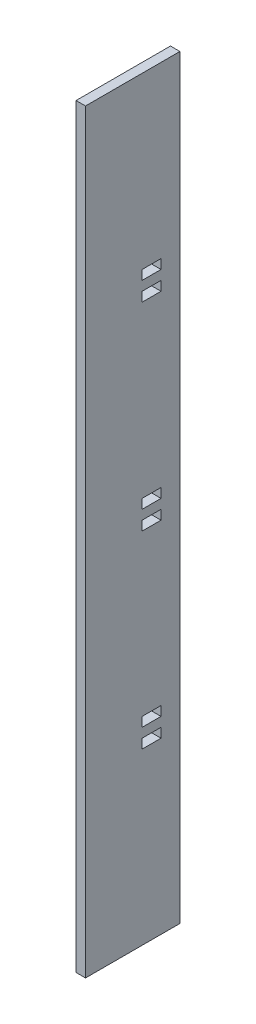
ISO-10303-21;
HEADER;
FILE_DESCRIPTION(('STEP AP214'),'2;1');
FILE_NAME('part.step','',(''),(''),'','','');
FILE_SCHEMA(('AUTOMOTIVE_DESIGN { 1 0 10303 214 1 1 1 1 }'));
ENDSEC;
DATA;
#1=APPLICATION_CONTEXT('core data for automotive mechanical design processes');
#2=APPLICATION_PROTOCOL_DEFINITION('international standard','automotive_design',2000,#1);
#3=PRODUCT_CONTEXT('',#1,'mechanical');
#4=PRODUCT('Part','Part','',(#3));
#5=PRODUCT_RELATED_PRODUCT_CATEGORY('part','',(#4));
#6=PRODUCT_DEFINITION_FORMATION('','',#4);
#7=PRODUCT_DEFINITION_CONTEXT('part definition',#1,'design');
#8=PRODUCT_DEFINITION('design','',#6,#7);
#9=PRODUCT_DEFINITION_SHAPE('','',#8);
#10=(LENGTH_UNIT() NAMED_UNIT(*) SI_UNIT(.MILLI.,.METRE.));
#11=(NAMED_UNIT(*) PLANE_ANGLE_UNIT() SI_UNIT($,.RADIAN.));
#12=(NAMED_UNIT(*) SI_UNIT($,.STERADIAN.) SOLID_ANGLE_UNIT());
#13=UNCERTAINTY_MEASURE_WITH_UNIT(LENGTH_MEASURE(1.E-05),#10,'distance_accuracy_value','');
#14=(GEOMETRIC_REPRESENTATION_CONTEXT(3) GLOBAL_UNCERTAINTY_ASSIGNED_CONTEXT((#13)) GLOBAL_UNIT_ASSIGNED_CONTEXT((#10,
#11,#12)) REPRESENTATION_CONTEXT('',''));
#15=CARTESIAN_POINT('',(0.,0.,0.));
#16=DIRECTION('',(0.,0.,1.));
#17=DIRECTION('',(1.,0.,0.));
#18=AXIS2_PLACEMENT_3D('',#15,#16,#17);
#19=CARTESIAN_POINT('',(6.35,0.,12.7));
#20=DIRECTION('',(0.,0.,1.));
#21=DIRECTION('',(-1.,0.,0.));
#22=AXIS2_PLACEMENT_3D('',#19,#20,#21);
#23=PLANE('',#22);
#24=DIRECTION('',(0.,-1.,0.));
#25=VECTOR('',#24,1.);
#26=CARTESIAN_POINT('',(0.,0.,12.7));
#27=LINE('',#26,#25);
#28=CARTESIAN_POINT('',(0.,381.,12.7));
#29=VERTEX_POINT('',#28);
#30=CARTESIAN_POINT('',(0.,374.65,12.7));
#31=VERTEX_POINT('',#30);
#32=EDGE_CURVE('E314',#29,#31,#27,.T.);
#33=ORIENTED_EDGE('',*,*,#32,.T.);
#34=DIRECTION('',(-1.,0.,0.));
#35=VECTOR('',#34,1.);
#36=CARTESIAN_POINT('',(6.35,374.65,12.7));
#37=LINE('',#36,#35);
#38=CARTESIAN_POINT('',(6.35,374.65,12.7));
#39=VERTEX_POINT('',#38);
#40=EDGE_CURVE('E322',#39,#31,#37,.T.);
#41=ORIENTED_EDGE('',*,*,#40,.F.);
#42=DIRECTION('',(0.,-1.,0.));
#43=VECTOR('',#42,1.);
#44=CARTESIAN_POINT('',(6.35,0.,12.7));
#45=LINE('',#44,#43);
#46=CARTESIAN_POINT('',(6.35,381.,12.7));
#47=VERTEX_POINT('',#46);
#48=EDGE_CURVE('E245',#47,#39,#45,.T.);
#49=ORIENTED_EDGE('',*,*,#48,.F.);
#50=DIRECTION('',(-1.,0.,0.));
#51=VECTOR('',#50,1.);
#52=CARTESIAN_POINT('',(6.35,381.,12.7));
#53=LINE('',#52,#51);
#54=EDGE_CURVE('E11',#47,#29,#53,.T.);
#55=ORIENTED_EDGE('',*,*,#54,.T.);
#56=EDGE_LOOP('',(#33,#41,#49,#55));
#57=FACE_BOUND('',#56,.T.);
#58=ADVANCED_FACE('F35',(#57),#23,.T.);
#59=CARTESIAN_POINT('',(6.35,381.,0.));
#60=DIRECTION('',(0.,1.,0.));
#61=DIRECTION('',(0.,0.,-1.));
#62=AXIS2_PLACEMENT_3D('',#59,#60,#61);
#63=PLANE('',#62);
#64=DIRECTION('',(0.,0.,1.));
#65=VECTOR('',#64,1.);
#66=CARTESIAN_POINT('',(0.,381.,0.));
#67=LINE('',#66,#65);
#68=CARTESIAN_POINT('',(0.,381.,25.4));
#69=VERTEX_POINT('',#68);
#70=EDGE_CURVE('E317',#29,#69,#67,.T.);
#71=ORIENTED_EDGE('',*,*,#70,.F.);
#72=ORIENTED_EDGE('',*,*,#54,.F.);
#73=DIRECTION('',(0.,0.,1.));
#74=VECTOR('',#73,1.);
#75=CARTESIAN_POINT('',(6.35,381.,0.));
#76=LINE('',#75,#74);
#77=CARTESIAN_POINT('',(6.35,381.,25.4));
#78=VERTEX_POINT('',#77);
#79=EDGE_CURVE('E232',#47,#78,#76,.T.);
#80=ORIENTED_EDGE('',*,*,#79,.T.);
#81=DIRECTION('',(-1.,0.,0.));
#82=VECTOR('',#81,1.);
#83=CARTESIAN_POINT('',(6.35,381.,25.4));
#84=LINE('',#83,#82);
#85=EDGE_CURVE('E45',#78,#69,#84,.T.);
#86=ORIENTED_EDGE('',*,*,#85,.T.);
#87=EDGE_LOOP('',(#71,#72,#80,#86));
#88=FACE_BOUND('',#87,.T.);
#89=ADVANCED_FACE('F243',(#88),#63,.F.);
#90=CARTESIAN_POINT('',(6.35,0.,25.4));
#91=DIRECTION('',(0.,0.,1.));
#92=DIRECTION('',(-1.,0.,0.));
#93=AXIS2_PLACEMENT_3D('',#90,#91,#92);
#94=PLANE('',#93);
#95=DIRECTION('',(0.,-1.,0.));
#96=VECTOR('',#95,1.);
#97=CARTESIAN_POINT('',(0.,0.,25.4));
#98=LINE('',#97,#96);
#99=CARTESIAN_POINT('',(0.,374.65,25.4));
#100=VERTEX_POINT('',#99);
#101=EDGE_CURVE('E238',#69,#100,#98,.T.);
#102=ORIENTED_EDGE('',*,*,#101,.F.);
#103=ORIENTED_EDGE('',*,*,#85,.F.);
#104=DIRECTION('',(0.,-1.,0.));
#105=VECTOR('',#104,1.);
#106=CARTESIAN_POINT('',(6.35,0.,25.4));
#107=LINE('',#106,#105);
#108=CARTESIAN_POINT('',(6.35,374.65,25.4));
#109=VERTEX_POINT('',#108);
#110=EDGE_CURVE('E228',#78,#109,#107,.T.);
#111=ORIENTED_EDGE('',*,*,#110,.T.);
#112=DIRECTION('',(-1.,0.,0.));
#113=VECTOR('',#112,1.);
#114=CARTESIAN_POINT('',(6.35,374.65,25.4));
#115=LINE('',#114,#113);
#116=EDGE_CURVE('E241',#109,#100,#115,.T.);
#117=ORIENTED_EDGE('',*,*,#116,.T.);
#118=EDGE_LOOP('',(#102,#103,#111,#117));
#119=FACE_BOUND('',#118,.T.);
#120=ADVANCED_FACE('F237',(#119),#94,.F.);
#121=CARTESIAN_POINT('',(6.35,247.65,0.));
#122=DIRECTION('',(0.,1.,0.));
#123=DIRECTION('',(0.,0.,-1.));
#124=AXIS2_PLACEMENT_3D('',#121,#122,#123);
#125=PLANE('',#124);
#126=DIRECTION('',(0.,0.,1.));
#127=VECTOR('',#126,1.);
#128=CARTESIAN_POINT('',(0.,247.65,0.));
#129=LINE('',#128,#127);
#130=CARTESIAN_POINT('',(0.,247.65,12.7));
#131=VERTEX_POINT('',#130);
#132=CARTESIAN_POINT('',(0.,247.65,25.4));
#133=VERTEX_POINT('',#132);
#134=EDGE_CURVE('E304',#131,#133,#129,.T.);
#135=ORIENTED_EDGE('',*,*,#134,.F.);
#136=DIRECTION('',(-1.,0.,0.));
#137=VECTOR('',#136,1.);
#138=CARTESIAN_POINT('',(6.35,247.65,12.7));
#139=LINE('',#138,#137);
#140=CARTESIAN_POINT('',(6.35,247.65,12.7));
#141=VERTEX_POINT('',#140);
#142=EDGE_CURVE('E326',#141,#131,#139,.T.);
#143=ORIENTED_EDGE('',*,*,#142,.F.);
#144=DIRECTION('',(0.,0.,1.));
#145=VECTOR('',#144,1.);
#146=CARTESIAN_POINT('',(6.35,247.65,0.));
#147=LINE('',#146,#145);
#148=CARTESIAN_POINT('',(6.35,247.65,25.4));
#149=VERTEX_POINT('',#148);
#150=EDGE_CURVE('E453',#141,#149,#147,.T.);
#151=ORIENTED_EDGE('',*,*,#150,.T.);
#152=DIRECTION('',(-1.,0.,0.));
#153=VECTOR('',#152,1.);
#154=CARTESIAN_POINT('',(6.35,247.65,25.4));
#155=LINE('',#154,#153);
#156=EDGE_CURVE('E324',#149,#133,#155,.T.);
#157=ORIENTED_EDGE('',*,*,#156,.T.);
#158=EDGE_LOOP('',(#135,#143,#151,#157));
#159=FACE_BOUND('',#158,.T.);
#160=ADVANCED_FACE('F476',(#159),#125,.F.);
#161=CARTESIAN_POINT('',(6.35,0.,25.4000000000001));
#162=DIRECTION('',(0.,0.,1.));
#163=DIRECTION('',(0.,1.,0.));
#164=AXIS2_PLACEMENT_3D('',#161,#162,#163);
#165=PLANE('',#164);
#166=DIRECTION('',(0.,-1.,0.));
#167=VECTOR('',#166,1.);
#168=CARTESIAN_POINT('',(0.,0.,25.4000000000001));
#169=LINE('',#168,#167);
#170=CARTESIAN_POINT('',(0.,241.3,25.4));
#171=VERTEX_POINT('',#170);
#172=EDGE_CURVE('E307',#133,#171,#169,.T.);
#173=ORIENTED_EDGE('',*,*,#172,.F.);
#174=ORIENTED_EDGE('',*,*,#156,.F.);
#175=DIRECTION('',(0.,-1.,0.));
#176=VECTOR('',#175,1.);
#177=CARTESIAN_POINT('',(6.35,0.,25.4000000000001));
#178=LINE('',#177,#176);
#179=CARTESIAN_POINT('',(6.35,241.3,25.4));
#180=VERTEX_POINT('',#179);
#181=EDGE_CURVE('E456',#149,#180,#178,.T.);
#182=ORIENTED_EDGE('',*,*,#181,.T.);
#183=DIRECTION('',(-1.,0.,0.));
#184=VECTOR('',#183,1.);
#185=CARTESIAN_POINT('',(6.35,241.3,25.4));
#186=LINE('',#185,#184);
#187=EDGE_CURVE('E333',#180,#171,#186,.T.);
#188=ORIENTED_EDGE('',*,*,#187,.T.);
#189=EDGE_LOOP('',(#173,#174,#182,#188));
#190=FACE_BOUND('',#189,.T.);
#191=ADVANCED_FACE('F473',(#190),#165,.F.);
#192=CARTESIAN_POINT('',(6.35,241.3,0.));
#193=DIRECTION('',(0.,1.,0.));
#194=DIRECTION('',(0.,0.,-1.));
#195=AXIS2_PLACEMENT_3D('',#192,#193,#194);
#196=PLANE('',#195);
#197=DIRECTION('',(0.,0.,1.));
#198=VECTOR('',#197,1.);
#199=CARTESIAN_POINT('',(0.,241.3,0.));
#200=LINE('',#199,#198);
#201=CARTESIAN_POINT('',(0.,241.3,12.7));
#202=VERTEX_POINT('',#201);
#203=EDGE_CURVE('E310',#202,#171,#200,.T.);
#204=ORIENTED_EDGE('',*,*,#203,.T.);
#205=ORIENTED_EDGE('',*,*,#187,.F.);
#206=DIRECTION('',(0.,0.,1.));
#207=VECTOR('',#206,1.);
#208=CARTESIAN_POINT('',(6.35,241.3,0.));
#209=LINE('',#208,#207);
#210=CARTESIAN_POINT('',(6.35,241.3,12.7));
#211=VERTEX_POINT('',#210);
#212=EDGE_CURVE('E459',#211,#180,#209,.T.);
#213=ORIENTED_EDGE('',*,*,#212,.F.);
#214=DIRECTION('',(-1.,0.,0.));
#215=VECTOR('',#214,1.);
#216=CARTESIAN_POINT('',(6.35,241.3,12.7));
#217=LINE('',#216,#215);
#218=EDGE_CURVE('E329',#211,#202,#217,.T.);
#219=ORIENTED_EDGE('',*,*,#218,.T.);
#220=EDGE_LOOP('',(#204,#205,#213,#219));
#221=FACE_BOUND('',#220,.T.);
#222=ADVANCED_FACE('F470',(#221),#196,.T.);
#223=CARTESIAN_POINT('',(6.35,120.65,0.));
#224=DIRECTION('',(0.,1.,0.));
#225=DIRECTION('',(0.,0.,-1.));
#226=AXIS2_PLACEMENT_3D('',#223,#224,#225);
#227=PLANE('',#226);
#228=DIRECTION('',(0.,0.,1.));
#229=VECTOR('',#228,1.);
#230=CARTESIAN_POINT('',(0.,120.65,0.));
#231=LINE('',#230,#229);
#232=CARTESIAN_POINT('',(0.,120.65,12.7));
#233=VERTEX_POINT('',#232);
#234=CARTESIAN_POINT('',(0.,120.65,25.4));
#235=VERTEX_POINT('',#234);
#236=EDGE_CURVE('E294',#233,#235,#231,.T.);
#237=ORIENTED_EDGE('',*,*,#236,.F.);
#238=DIRECTION('',(-1.,0.,0.));
#239=VECTOR('',#238,1.);
#240=CARTESIAN_POINT('',(6.35,120.65,12.7));
#241=LINE('',#240,#239);
#242=CARTESIAN_POINT('',(6.35,120.65,12.7));
#243=VERTEX_POINT('',#242);
#244=EDGE_CURVE('E338',#243,#233,#241,.T.);
#245=ORIENTED_EDGE('',*,*,#244,.F.);
#246=DIRECTION('',(0.,0.,1.));
#247=VECTOR('',#246,1.);
#248=CARTESIAN_POINT('',(6.35,120.65,0.));
#249=LINE('',#248,#247);
#250=CARTESIAN_POINT('',(6.35,120.65,25.4));
#251=VERTEX_POINT('',#250);
#252=EDGE_CURVE('E443',#243,#251,#249,.T.);
#253=ORIENTED_EDGE('',*,*,#252,.T.);
#254=DIRECTION('',(-1.,0.,0.));
#255=VECTOR('',#254,1.);
#256=CARTESIAN_POINT('',(6.35,120.65,25.4));
#257=LINE('',#256,#255);
#258=EDGE_CURVE('E330',#251,#235,#257,.T.);
#259=ORIENTED_EDGE('',*,*,#258,.T.);
#260=EDGE_LOOP('',(#237,#245,#253,#259));
#261=FACE_BOUND('',#260,.T.);
#262=ADVANCED_FACE('F506',(#261),#227,.F.);
#263=CARTESIAN_POINT('',(6.35,0.,25.4));
#264=DIRECTION('',(0.,0.,1.));
#265=DIRECTION('',(-1.,0.,0.));
#266=AXIS2_PLACEMENT_3D('',#263,#264,#265);
#267=PLANE('',#266);
#268=DIRECTION('',(0.,-1.,0.));
#269=VECTOR('',#268,1.);
#270=CARTESIAN_POINT('',(0.,0.,25.4));
#271=LINE('',#270,#269);
#272=CARTESIAN_POINT('',(0.,114.3,25.4));
#273=VERTEX_POINT('',#272);
#274=EDGE_CURVE('E297',#235,#273,#271,.T.);
#275=ORIENTED_EDGE('',*,*,#274,.F.);
#276=ORIENTED_EDGE('',*,*,#258,.F.);
#277=DIRECTION('',(0.,-1.,0.));
#278=VECTOR('',#277,1.);
#279=CARTESIAN_POINT('',(6.35,0.,25.4));
#280=LINE('',#279,#278);
#281=CARTESIAN_POINT('',(6.35,114.3,25.4));
#282=VERTEX_POINT('',#281);
#283=EDGE_CURVE('E446',#251,#282,#280,.T.);
#284=ORIENTED_EDGE('',*,*,#283,.T.);
#285=DIRECTION('',(-1.,0.,0.));
#286=VECTOR('',#285,1.);
#287=CARTESIAN_POINT('',(6.35,114.3,25.4));
#288=LINE('',#287,#286);
#289=EDGE_CURVE('E345',#282,#273,#288,.T.);
#290=ORIENTED_EDGE('',*,*,#289,.T.);
#291=EDGE_LOOP('',(#275,#276,#284,#290));
#292=FACE_BOUND('',#291,.T.);
#293=ADVANCED_FACE('F519',(#292),#267,.F.);
#294=CARTESIAN_POINT('',(6.35,114.3,0.));
#295=DIRECTION('',(0.,1.,0.));
#296=DIRECTION('',(0.,0.,-1.));
#297=AXIS2_PLACEMENT_3D('',#294,#295,#296);
#298=PLANE('',#297);
#299=DIRECTION('',(0.,0.,1.));
#300=VECTOR('',#299,1.);
#301=CARTESIAN_POINT('',(0.,114.3,0.));
#302=LINE('',#301,#300);
#303=CARTESIAN_POINT('',(0.,114.3,12.7));
#304=VERTEX_POINT('',#303);
#305=EDGE_CURVE('E300',#304,#273,#302,.T.);
#306=ORIENTED_EDGE('',*,*,#305,.T.);
#307=ORIENTED_EDGE('',*,*,#289,.F.);
#308=DIRECTION('',(0.,0.,1.));
#309=VECTOR('',#308,1.);
#310=CARTESIAN_POINT('',(6.35,114.3,0.));
#311=LINE('',#310,#309);
#312=CARTESIAN_POINT('',(6.35,114.3,12.7));
#313=VERTEX_POINT('',#312);
#314=EDGE_CURVE('E449',#313,#282,#311,.T.);
#315=ORIENTED_EDGE('',*,*,#314,.F.);
#316=DIRECTION('',(-1.,0.,0.));
#317=VECTOR('',#316,1.);
#318=CARTESIAN_POINT('',(6.35,114.3,12.7));
#319=LINE('',#318,#317);
#320=EDGE_CURVE('E341',#313,#304,#319,.T.);
#321=ORIENTED_EDGE('',*,*,#320,.T.);
#322=EDGE_LOOP('',(#306,#307,#315,#321));
#323=FACE_BOUND('',#322,.T.);
#324=ADVANCED_FACE('F515',(#323),#298,.T.);
#325=CARTESIAN_POINT('',(6.35,260.35,0.));
#326=DIRECTION('',(0.,1.,0.));
#327=DIRECTION('',(0.,0.,-1.));
#328=AXIS2_PLACEMENT_3D('',#325,#326,#327);
#329=PLANE('',#328);
#330=DIRECTION('',(0.,0.,1.));
#331=VECTOR('',#330,1.);
#332=CARTESIAN_POINT('',(0.,260.35,0.));
#333=LINE('',#332,#331);
#334=CARTESIAN_POINT('',(0.,260.35,12.7));
#335=VERTEX_POINT('',#334);
#336=CARTESIAN_POINT('',(0.,260.35,25.4));
#337=VERTEX_POINT('',#336);
#338=EDGE_CURVE('E284',#335,#337,#333,.T.);
#339=ORIENTED_EDGE('',*,*,#338,.F.);
#340=DIRECTION('',(-1.,0.,0.));
#341=VECTOR('',#340,1.);
#342=CARTESIAN_POINT('',(6.35,260.35,12.7));
#343=LINE('',#342,#341);
#344=CARTESIAN_POINT('',(6.35,260.35,12.7));
#345=VERTEX_POINT('',#344);
#346=EDGE_CURVE('E350',#345,#335,#343,.T.);
#347=ORIENTED_EDGE('',*,*,#346,.F.);
#348=DIRECTION('',(0.,0.,1.));
#349=VECTOR('',#348,1.);
#350=CARTESIAN_POINT('',(6.35,260.35,0.));
#351=LINE('',#350,#349);
#352=CARTESIAN_POINT('',(6.35,260.35,25.4));
#353=VERTEX_POINT('',#352);
#354=EDGE_CURVE('E433',#345,#353,#351,.T.);
#355=ORIENTED_EDGE('',*,*,#354,.T.);
#356=DIRECTION('',(-1.,0.,0.));
#357=VECTOR('',#356,1.);
#358=CARTESIAN_POINT('',(6.35,260.35,25.4));
#359=LINE('',#358,#357);
#360=EDGE_CURVE('E342',#353,#337,#359,.T.);
#361=ORIENTED_EDGE('',*,*,#360,.T.);
#362=EDGE_LOOP('',(#339,#347,#355,#361));
#363=FACE_BOUND('',#362,.T.);
#364=ADVANCED_FACE('F518',(#363),#329,.F.);
#365=CARTESIAN_POINT('',(6.35,0.,25.4));
#366=DIRECTION('',(0.,0.,1.));
#367=DIRECTION('',(-1.,0.,0.));
#368=AXIS2_PLACEMENT_3D('',#365,#366,#367);
#369=PLANE('',#368);
#370=DIRECTION('',(0.,-1.,0.));
#371=VECTOR('',#370,1.);
#372=CARTESIAN_POINT('',(0.,0.,25.4));
#373=LINE('',#372,#371);
#374=CARTESIAN_POINT('',(0.,254.,25.4));
#375=VERTEX_POINT('',#374);
#376=EDGE_CURVE('E287',#337,#375,#373,.T.);
#377=ORIENTED_EDGE('',*,*,#376,.F.);
#378=ORIENTED_EDGE('',*,*,#360,.F.);
#379=DIRECTION('',(0.,-1.,0.));
#380=VECTOR('',#379,1.);
#381=CARTESIAN_POINT('',(6.35,0.,25.4));
#382=LINE('',#381,#380);
#383=CARTESIAN_POINT('',(6.35,254.,25.4));
#384=VERTEX_POINT('',#383);
#385=EDGE_CURVE('E436',#353,#384,#382,.T.);
#386=ORIENTED_EDGE('',*,*,#385,.T.);
#387=DIRECTION('',(-1.,0.,0.));
#388=VECTOR('',#387,1.);
#389=CARTESIAN_POINT('',(6.35,254.,25.4));
#390=LINE('',#389,#388);
#391=EDGE_CURVE('E357',#384,#375,#390,.T.);
#392=ORIENTED_EDGE('',*,*,#391,.T.);
#393=EDGE_LOOP('',(#377,#378,#386,#392));
#394=FACE_BOUND('',#393,.T.);
#395=ADVANCED_FACE('F535',(#394),#369,.F.);
#396=CARTESIAN_POINT('',(6.35,254.,0.));
#397=DIRECTION('',(0.,1.,0.));
#398=DIRECTION('',(0.,0.,-1.));
#399=AXIS2_PLACEMENT_3D('',#396,#397,#398);
#400=PLANE('',#399);
#401=DIRECTION('',(0.,0.,1.));
#402=VECTOR('',#401,1.);
#403=CARTESIAN_POINT('',(0.,254.,0.));
#404=LINE('',#403,#402);
#405=CARTESIAN_POINT('',(0.,254.,12.7));
#406=VERTEX_POINT('',#405);
#407=EDGE_CURVE('E290',#406,#375,#404,.T.);
#408=ORIENTED_EDGE('',*,*,#407,.T.);
#409=ORIENTED_EDGE('',*,*,#391,.F.);
#410=DIRECTION('',(0.,0.,1.));
#411=VECTOR('',#410,1.);
#412=CARTESIAN_POINT('',(6.35,254.,0.));
#413=LINE('',#412,#411);
#414=CARTESIAN_POINT('',(6.35,254.,12.7));
#415=VERTEX_POINT('',#414);
#416=EDGE_CURVE('E439',#415,#384,#413,.T.);
#417=ORIENTED_EDGE('',*,*,#416,.F.);
#418=DIRECTION('',(-1.,0.,0.));
#419=VECTOR('',#418,1.);
#420=CARTESIAN_POINT('',(6.35,254.,12.7));
#421=LINE('',#420,#419);
#422=EDGE_CURVE('E353',#415,#406,#421,.T.);
#423=ORIENTED_EDGE('',*,*,#422,.T.);
#424=EDGE_LOOP('',(#408,#409,#417,#423));
#425=FACE_BOUND('',#424,.T.);
#426=ADVANCED_FACE('F531',(#425),#400,.T.);
#427=CARTESIAN_POINT('',(6.35,0.,0.));
#428=DIRECTION('',(0.,1.,0.));
#429=DIRECTION('',(0.,0.,-1.));
#430=AXIS2_PLACEMENT_3D('',#427,#428,#429);
#431=PLANE('',#430);
#432=DIRECTION('',(0.,0.,1.));
#433=VECTOR('',#432,1.);
#434=CARTESIAN_POINT('',(0.,0.,0.));
#435=LINE('',#434,#433);
#436=CARTESIAN_POINT('',(0.,0.,0.));
#437=VERTEX_POINT('',#436);
#438=CARTESIAN_POINT('',(0.,0.,63.5));
#439=VERTEX_POINT('',#438);
#440=EDGE_CURVE('E274',#437,#439,#435,.T.);
#441=ORIENTED_EDGE('',*,*,#440,.F.);
#442=DIRECTION('',(-1.,0.,0.));
#443=VECTOR('',#442,1.);
#444=CARTESIAN_POINT('',(6.35,0.,0.));
#445=LINE('',#444,#443);
#446=CARTESIAN_POINT('',(6.35,0.,0.));
#447=VERTEX_POINT('',#446);
#448=EDGE_CURVE('E362',#447,#437,#445,.T.);
#449=ORIENTED_EDGE('',*,*,#448,.F.);
#450=DIRECTION('',(0.,0.,1.));
#451=VECTOR('',#450,1.);
#452=CARTESIAN_POINT('',(6.35,0.,0.));
#453=LINE('',#452,#451);
#454=CARTESIAN_POINT('',(6.35,0.,63.5));
#455=VERTEX_POINT('',#454);
#456=EDGE_CURVE('E423',#447,#455,#453,.T.);
#457=ORIENTED_EDGE('',*,*,#456,.T.);
#458=DIRECTION('',(-1.,0.,0.));
#459=VECTOR('',#458,1.);
#460=CARTESIAN_POINT('',(6.35,0.,63.5));
#461=LINE('',#460,#459);
#462=EDGE_CURVE('E354',#455,#439,#461,.T.);
#463=ORIENTED_EDGE('',*,*,#462,.T.);
#464=EDGE_LOOP('',(#441,#449,#457,#463));
#465=FACE_BOUND('',#464,.T.);
#466=ADVANCED_FACE('F534',(#465),#431,.F.);
#467=CARTESIAN_POINT('',(6.35,0.,63.5));
#468=DIRECTION('',(0.,0.,-1.));
#469=DIRECTION('',(1.,0.,0.));
#470=AXIS2_PLACEMENT_3D('',#467,#468,#469);
#471=PLANE('',#470);
#472=DIRECTION('',(0.,1.,0.));
#473=VECTOR('',#472,1.);
#474=CARTESIAN_POINT('',(0.,0.,63.5));
#475=LINE('',#474,#473);
#476=CARTESIAN_POINT('',(0.,508.,63.5));
#477=VERTEX_POINT('',#476);
#478=EDGE_CURVE('E277',#439,#477,#475,.T.);
#479=ORIENTED_EDGE('',*,*,#478,.F.);
#480=ORIENTED_EDGE('',*,*,#462,.F.);
#481=DIRECTION('',(0.,1.,0.));
#482=VECTOR('',#481,1.);
#483=CARTESIAN_POINT('',(6.35,0.,63.5));
#484=LINE('',#483,#482);
#485=CARTESIAN_POINT('',(6.35,508.,63.5));
#486=VERTEX_POINT('',#485);
#487=EDGE_CURVE('E426',#455,#486,#484,.T.);
#488=ORIENTED_EDGE('',*,*,#487,.T.);
#489=DIRECTION('',(-1.,0.,0.));
#490=VECTOR('',#489,1.);
#491=CARTESIAN_POINT('',(6.35,508.,63.5));
#492=LINE('',#491,#490);
#493=EDGE_CURVE('E369',#486,#477,#492,.T.);
#494=ORIENTED_EDGE('',*,*,#493,.T.);
#495=EDGE_LOOP('',(#479,#480,#488,#494));
#496=FACE_BOUND('',#495,.T.);
#497=ADVANCED_FACE('F550',(#496),#471,.F.);
#498=CARTESIAN_POINT('',(6.35,508.,0.));
#499=DIRECTION('',(0.,1.,0.));
#500=DIRECTION('',(0.,0.,-1.));
#501=AXIS2_PLACEMENT_3D('',#498,#499,#500);
#502=PLANE('',#501);
#503=DIRECTION('',(0.,0.,1.));
#504=VECTOR('',#503,1.);
#505=CARTESIAN_POINT('',(0.,508.,0.));
#506=LINE('',#505,#504);
#507=CARTESIAN_POINT('',(0.,508.,0.));
#508=VERTEX_POINT('',#507);
#509=EDGE_CURVE('E280',#508,#477,#506,.T.);
#510=ORIENTED_EDGE('',*,*,#509,.T.);
#511=ORIENTED_EDGE('',*,*,#493,.F.);
#512=DIRECTION('',(0.,0.,1.));
#513=VECTOR('',#512,1.);
#514=CARTESIAN_POINT('',(6.35,508.,0.));
#515=LINE('',#514,#513);
#516=CARTESIAN_POINT('',(6.35,508.,0.));
#517=VERTEX_POINT('',#516);
#518=EDGE_CURVE('E429',#517,#486,#515,.T.);
#519=ORIENTED_EDGE('',*,*,#518,.F.);
#520=DIRECTION('',(-1.,0.,0.));
#521=VECTOR('',#520,1.);
#522=CARTESIAN_POINT('',(6.35,508.,0.));
#523=LINE('',#522,#521);
#524=EDGE_CURVE('E365',#517,#508,#523,.T.);
#525=ORIENTED_EDGE('',*,*,#524,.T.);
#526=EDGE_LOOP('',(#510,#511,#519,#525));
#527=FACE_BOUND('',#526,.T.);
#528=ADVANCED_FACE('F546',(#527),#502,.T.);
#529=CARTESIAN_POINT('',(6.35,0.,25.4));
#530=DIRECTION('',(0.,0.,-1.));
#531=DIRECTION('',(1.,0.,0.));
#532=AXIS2_PLACEMENT_3D('',#529,#530,#531);
#533=PLANE('',#532);
#534=DIRECTION('',(0.,1.,0.));
#535=VECTOR('',#534,1.);
#536=CARTESIAN_POINT('',(0.,0.,25.4));
#537=LINE('',#536,#535);
#538=CARTESIAN_POINT('',(0.,127.,25.4));
#539=VERTEX_POINT('',#538);
#540=CARTESIAN_POINT('',(0.,133.35,25.4));
#541=VERTEX_POINT('',#540);
#542=EDGE_CURVE('E264',#539,#541,#537,.T.);
#543=ORIENTED_EDGE('',*,*,#542,.T.);
#544=DIRECTION('',(-1.,0.,0.));
#545=VECTOR('',#544,1.);
#546=CARTESIAN_POINT('',(6.35,133.35,25.4));
#547=LINE('',#546,#545);
#548=CARTESIAN_POINT('',(6.35,133.35,25.4));
#549=VERTEX_POINT('',#548);
#550=EDGE_CURVE('E374',#549,#541,#547,.T.);
#551=ORIENTED_EDGE('',*,*,#550,.F.);
#552=DIRECTION('',(0.,1.,0.));
#553=VECTOR('',#552,1.);
#554=CARTESIAN_POINT('',(6.35,0.,25.4));
#555=LINE('',#554,#553);
#556=CARTESIAN_POINT('',(6.35,127.,25.4));
#557=VERTEX_POINT('',#556);
#558=EDGE_CURVE('E406',#557,#549,#555,.T.);
#559=ORIENTED_EDGE('',*,*,#558,.F.);
#560=DIRECTION('',(-1.,0.,0.));
#561=VECTOR('',#560,1.);
#562=CARTESIAN_POINT('',(6.35,127.,25.4));
#563=LINE('',#562,#561);
#564=EDGE_CURVE('E366',#557,#539,#563,.T.);
#565=ORIENTED_EDGE('',*,*,#564,.T.);
#566=EDGE_LOOP('',(#543,#551,#559,#565));
#567=FACE_BOUND('',#566,.T.);
#568=ADVANCED_FACE('F549',(#567),#533,.T.);
#569=CARTESIAN_POINT('',(6.35,127.,0.));
#570=DIRECTION('',(0.,1.,0.));
#571=DIRECTION('',(0.,0.,-1.));
#572=AXIS2_PLACEMENT_3D('',#569,#570,#571);
#573=PLANE('',#572);
#574=DIRECTION('',(0.,0.,1.));
#575=VECTOR('',#574,1.);
#576=CARTESIAN_POINT('',(0.,127.,0.));
#577=LINE('',#576,#575);
#578=CARTESIAN_POINT('',(0.,127.,12.7));
#579=VERTEX_POINT('',#578);
#580=EDGE_CURVE('E267',#579,#539,#577,.T.);
#581=ORIENTED_EDGE('',*,*,#580,.T.);
#582=ORIENTED_EDGE('',*,*,#564,.F.);
#583=DIRECTION('',(0.,0.,1.));
#584=VECTOR('',#583,1.);
#585=CARTESIAN_POINT('',(6.35,127.,0.));
#586=LINE('',#585,#584);
#587=CARTESIAN_POINT('',(6.35,127.,12.7));
#588=VERTEX_POINT('',#587);
#589=EDGE_CURVE('E416',#588,#557,#586,.T.);
#590=ORIENTED_EDGE('',*,*,#589,.F.);
#591=DIRECTION('',(-1.,0.,0.));
#592=VECTOR('',#591,1.);
#593=CARTESIAN_POINT('',(6.35,127.,12.7));
#594=LINE('',#593,#592);
#595=EDGE_CURVE('E380',#588,#579,#594,.T.);
#596=ORIENTED_EDGE('',*,*,#595,.T.);
#597=EDGE_LOOP('',(#581,#582,#590,#596));
#598=FACE_BOUND('',#597,.T.);
#599=ADVANCED_FACE('F564',(#598),#573,.T.);
#600=CARTESIAN_POINT('',(6.35,0.,12.7));
#601=DIRECTION('',(0.,0.,-1.));
#602=DIRECTION('',(1.,0.,0.));
#603=AXIS2_PLACEMENT_3D('',#600,#601,#602);
#604=PLANE('',#603);
#605=DIRECTION('',(0.,1.,0.));
#606=VECTOR('',#605,1.);
#607=CARTESIAN_POINT('',(0.,0.,12.7));
#608=LINE('',#607,#606);
#609=CARTESIAN_POINT('',(0.,133.35,12.7));
#610=VERTEX_POINT('',#609);
#611=EDGE_CURVE('E269',#579,#610,#608,.T.);
#612=ORIENTED_EDGE('',*,*,#611,.F.);
#613=ORIENTED_EDGE('',*,*,#595,.F.);
#614=DIRECTION('',(0.,1.,0.));
#615=VECTOR('',#614,1.);
#616=CARTESIAN_POINT('',(6.35,0.,12.7));
#617=LINE('',#616,#615);
#618=CARTESIAN_POINT('',(6.35,133.35,12.7));
#619=VERTEX_POINT('',#618);
#620=EDGE_CURVE('E418',#588,#619,#617,.T.);
#621=ORIENTED_EDGE('',*,*,#620,.T.);
#622=DIRECTION('',(-1.,0.,0.));
#623=VECTOR('',#622,1.);
#624=CARTESIAN_POINT('',(6.35,133.35,12.7));
#625=LINE('',#624,#623);
#626=EDGE_CURVE('E377',#619,#610,#625,.T.);
#627=ORIENTED_EDGE('',*,*,#626,.T.);
#628=EDGE_LOOP('',(#612,#613,#621,#627));
#629=FACE_BOUND('',#628,.T.);
#630=ADVANCED_FACE('F561',(#629),#604,.F.);
#631=CARTESIAN_POINT('',(6.35,387.35,0.));
#632=DIRECTION('',(0.,1.,0.));
#633=DIRECTION('',(0.,0.,-1.));
#634=AXIS2_PLACEMENT_3D('',#631,#632,#633);
#635=PLANE('',#634);
#636=DIRECTION('',(0.,0.,1.));
#637=VECTOR('',#636,1.);
#638=CARTESIAN_POINT('',(0.,387.35,0.));
#639=LINE('',#638,#637);
#640=CARTESIAN_POINT('',(0.,387.35,12.7));
#641=VERTEX_POINT('',#640);
#642=CARTESIAN_POINT('',(0.,387.35,25.4));
#643=VERTEX_POINT('',#642);
#644=EDGE_CURVE('E253',#641,#643,#639,.T.);
#645=ORIENTED_EDGE('',*,*,#644,.T.);
#646=DIRECTION('',(-1.,0.,0.));
#647=VECTOR('',#646,1.);
#648=CARTESIAN_POINT('',(6.35,387.35,25.4));
#649=LINE('',#648,#647);
#650=CARTESIAN_POINT('',(6.35,387.35,25.4));
#651=VERTEX_POINT('',#650);
#652=EDGE_CURVE('E252',#651,#643,#649,.T.);
#653=ORIENTED_EDGE('',*,*,#652,.F.);
#654=DIRECTION('',(0.,0.,1.));
#655=VECTOR('',#654,1.);
#656=CARTESIAN_POINT('',(6.35,387.35,0.));
#657=LINE('',#656,#655);
#658=CARTESIAN_POINT('',(6.35,387.35,12.7));
#659=VERTEX_POINT('',#658);
#660=EDGE_CURVE('E321',#659,#651,#657,.T.);
#661=ORIENTED_EDGE('',*,*,#660,.F.);
#662=DIRECTION('',(-1.,0.,0.));
#663=VECTOR('',#662,1.);
#664=CARTESIAN_POINT('',(6.35,387.35,12.7));
#665=LINE('',#664,#663);
#666=EDGE_CURVE('E39',#659,#641,#665,.T.);
#667=ORIENTED_EDGE('',*,*,#666,.T.);
#668=EDGE_LOOP('',(#645,#653,#661,#667));
#669=FACE_BOUND('',#668,.T.);
#670=ADVANCED_FACE('F37',(#669),#635,.T.);
#671=CARTESIAN_POINT('',(6.35,0.,12.7));
#672=DIRECTION('',(0.,0.,-1.));
#673=DIRECTION('',(1.,0.,0.));
#674=AXIS2_PLACEMENT_3D('',#671,#672,#673);
#675=PLANE('',#674);
#676=DIRECTION('',(0.,1.,0.));
#677=VECTOR('',#676,1.);
#678=CARTESIAN_POINT('',(0.,0.,12.7));
#679=LINE('',#678,#677);
#680=CARTESIAN_POINT('',(0.,393.7,12.7));
#681=VERTEX_POINT('',#680);
#682=EDGE_CURVE('E256',#641,#681,#679,.T.);
#683=ORIENTED_EDGE('',*,*,#682,.F.);
#684=ORIENTED_EDGE('',*,*,#666,.F.);
#685=DIRECTION('',(0.,1.,0.));
#686=VECTOR('',#685,1.);
#687=CARTESIAN_POINT('',(6.35,0.,12.7));
#688=LINE('',#687,#686);
#689=CARTESIAN_POINT('',(6.35,393.7,12.7));
#690=VERTEX_POINT('',#689);
#691=EDGE_CURVE('E153',#659,#690,#688,.T.);
#692=ORIENTED_EDGE('',*,*,#691,.T.);
#693=DIRECTION('',(-1.,0.,0.));
#694=VECTOR('',#693,1.);
#695=CARTESIAN_POINT('',(6.35,393.7,12.7));
#696=LINE('',#695,#694);
#697=EDGE_CURVE('E389',#690,#681,#696,.T.);
#698=ORIENTED_EDGE('',*,*,#697,.T.);
#699=EDGE_LOOP('',(#683,#684,#692,#698));
#700=FACE_BOUND('',#699,.T.);
#701=ADVANCED_FACE('F573',(#700),#675,.F.);
#702=CARTESIAN_POINT('',(6.35,393.7,0.));
#703=DIRECTION('',(0.,1.,0.));
#704=DIRECTION('',(0.,0.,-1.));
#705=AXIS2_PLACEMENT_3D('',#702,#703,#704);
#706=PLANE('',#705);
#707=DIRECTION('',(0.,0.,1.));
#708=VECTOR('',#707,1.);
#709=CARTESIAN_POINT('',(0.,393.7,0.));
#710=LINE('',#709,#708);
#711=CARTESIAN_POINT('',(0.,393.7,25.4));
#712=VERTEX_POINT('',#711);
#713=EDGE_CURVE('E259',#681,#712,#710,.T.);
#714=ORIENTED_EDGE('',*,*,#713,.F.);
#715=ORIENTED_EDGE('',*,*,#697,.F.);
#716=DIRECTION('',(0.,0.,1.));
#717=VECTOR('',#716,1.);
#718=CARTESIAN_POINT('',(6.35,393.7,0.));
#719=LINE('',#718,#717);
#720=CARTESIAN_POINT('',(6.35,393.7,25.4));
#721=VERTEX_POINT('',#720);
#722=EDGE_CURVE('E407',#690,#721,#719,.T.);
#723=ORIENTED_EDGE('',*,*,#722,.T.);
#724=DIRECTION('',(-1.,0.,0.));
#725=VECTOR('',#724,1.);
#726=CARTESIAN_POINT('',(6.35,393.7,25.4));
#727=LINE('',#726,#725);
#728=EDGE_CURVE('E387',#721,#712,#727,.T.);
#729=ORIENTED_EDGE('',*,*,#728,.T.);
#730=EDGE_LOOP('',(#714,#715,#723,#729));
#731=FACE_BOUND('',#730,.T.);
#732=ADVANCED_FACE('F503',(#731),#706,.F.);
#733=CARTESIAN_POINT('',(6.35,0.,12.7));
#734=DIRECTION('',(0.,0.,1.));
#735=DIRECTION('',(-1.,0.,0.));
#736=AXIS2_PLACEMENT_3D('',#733,#734,#735);
#737=PLANE('',#736);
#738=DIRECTION('',(0.,-1.,0.));
#739=VECTOR('',#738,1.);
#740=CARTESIAN_POINT('',(0.,0.,12.7));
#741=LINE('',#740,#739);
#742=EDGE_CURVE('E312',#131,#202,#741,.T.);
#743=ORIENTED_EDGE('',*,*,#742,.T.);
#744=ORIENTED_EDGE('',*,*,#218,.F.);
#745=DIRECTION('',(0.,-1.,0.));
#746=VECTOR('',#745,1.);
#747=CARTESIAN_POINT('',(6.35,0.,12.7));
#748=LINE('',#747,#746);
#749=EDGE_CURVE('E247',#141,#211,#748,.T.);
#750=ORIENTED_EDGE('',*,*,#749,.F.);
#751=ORIENTED_EDGE('',*,*,#142,.T.);
#752=EDGE_LOOP('',(#743,#744,#750,#751));
#753=FACE_BOUND('',#752,.T.);
#754=ADVANCED_FACE('F467',(#753),#737,.T.);
#755=CARTESIAN_POINT('',(6.35,0.,12.7));
#756=DIRECTION('',(0.,0.,1.));
#757=DIRECTION('',(-1.,0.,0.));
#758=AXIS2_PLACEMENT_3D('',#755,#756,#757);
#759=PLANE('',#758);
#760=DIRECTION('',(0.,-1.,0.));
#761=VECTOR('',#760,1.);
#762=CARTESIAN_POINT('',(0.,0.,12.7));
#763=LINE('',#762,#761);
#764=EDGE_CURVE('E302',#233,#304,#763,.T.);
#765=ORIENTED_EDGE('',*,*,#764,.T.);
#766=ORIENTED_EDGE('',*,*,#320,.F.);
#767=DIRECTION('',(0.,-1.,0.));
#768=VECTOR('',#767,1.);
#769=CARTESIAN_POINT('',(6.35,0.,12.7));
#770=LINE('',#769,#768);
#771=EDGE_CURVE('E451',#243,#313,#770,.T.);
#772=ORIENTED_EDGE('',*,*,#771,.F.);
#773=ORIENTED_EDGE('',*,*,#244,.T.);
#774=EDGE_LOOP('',(#765,#766,#772,#773));
#775=FACE_BOUND('',#774,.T.);
#776=ADVANCED_FACE('F502',(#775),#759,.T.);
#777=CARTESIAN_POINT('',(6.35,0.,12.7000000000013));
#778=DIRECTION('',(0.,0.,1.));
#779=DIRECTION('',(0.,1.,0.));
#780=AXIS2_PLACEMENT_3D('',#777,#778,#779);
#781=PLANE('',#780);
#782=DIRECTION('',(0.,-1.,0.));
#783=VECTOR('',#782,1.);
#784=CARTESIAN_POINT('',(0.,0.,12.7000000000013));
#785=LINE('',#784,#783);
#786=EDGE_CURVE('E292',#335,#406,#785,.T.);
#787=ORIENTED_EDGE('',*,*,#786,.T.);
#788=ORIENTED_EDGE('',*,*,#422,.F.);
#789=DIRECTION('',(0.,-1.,0.));
#790=VECTOR('',#789,1.);
#791=CARTESIAN_POINT('',(6.35,0.,12.7000000000013));
#792=LINE('',#791,#790);
#793=EDGE_CURVE('E441',#345,#415,#792,.T.);
#794=ORIENTED_EDGE('',*,*,#793,.F.);
#795=ORIENTED_EDGE('',*,*,#346,.T.);
#796=EDGE_LOOP('',(#787,#788,#794,#795));
#797=FACE_BOUND('',#796,.T.);
#798=ADVANCED_FACE('F513',(#797),#781,.T.);
#799=CARTESIAN_POINT('',(6.35,0.,0.));
#800=DIRECTION('',(0.,0.,-1.));
#801=DIRECTION('',(1.,0.,0.));
#802=AXIS2_PLACEMENT_3D('',#799,#800,#801);
#803=PLANE('',#802);
#804=DIRECTION('',(0.,1.,0.));
#805=VECTOR('',#804,1.);
#806=CARTESIAN_POINT('',(0.,0.,0.));
#807=LINE('',#806,#805);
#808=EDGE_CURVE('E282',#437,#508,#807,.T.);
#809=ORIENTED_EDGE('',*,*,#808,.T.);
#810=ORIENTED_EDGE('',*,*,#524,.F.);
#811=DIRECTION('',(0.,1.,0.));
#812=VECTOR('',#811,1.);
#813=CARTESIAN_POINT('',(6.35,0.,0.));
#814=LINE('',#813,#812);
#815=EDGE_CURVE('E431',#447,#517,#814,.T.);
#816=ORIENTED_EDGE('',*,*,#815,.F.);
#817=ORIENTED_EDGE('',*,*,#448,.T.);
#818=EDGE_LOOP('',(#809,#810,#816,#817));
#819=FACE_BOUND('',#818,.T.);
#820=ADVANCED_FACE('F529',(#819),#803,.T.);
#821=CARTESIAN_POINT('',(6.35,133.35,0.));
#822=DIRECTION('',(0.,1.,0.));
#823=DIRECTION('',(0.,0.,-1.));
#824=AXIS2_PLACEMENT_3D('',#821,#822,#823);
#825=PLANE('',#824);
#826=DIRECTION('',(0.,0.,1.));
#827=VECTOR('',#826,1.);
#828=CARTESIAN_POINT('',(0.,133.35,0.));
#829=LINE('',#828,#827);
#830=EDGE_CURVE('E272',#610,#541,#829,.T.);
#831=ORIENTED_EDGE('',*,*,#830,.F.);
#832=ORIENTED_EDGE('',*,*,#626,.F.);
#833=DIRECTION('',(0.,0.,1.));
#834=VECTOR('',#833,1.);
#835=CARTESIAN_POINT('',(6.35,133.35,0.));
#836=LINE('',#835,#834);
#837=EDGE_CURVE('E421',#619,#549,#836,.T.);
#838=ORIENTED_EDGE('',*,*,#837,.T.);
#839=ORIENTED_EDGE('',*,*,#550,.T.);
#840=EDGE_LOOP('',(#831,#832,#838,#839));
#841=FACE_BOUND('',#840,.T.);
#842=ADVANCED_FACE('F490',(#841),#825,.F.);
#843=CARTESIAN_POINT('',(6.35,0.,25.4));
#844=DIRECTION('',(0.,0.,-1.));
#845=DIRECTION('',(1.,0.,0.));
#846=AXIS2_PLACEMENT_3D('',#843,#844,#845);
#847=PLANE('',#846);
#848=DIRECTION('',(0.,1.,0.));
#849=VECTOR('',#848,1.);
#850=CARTESIAN_POINT('',(0.,0.,25.4));
#851=LINE('',#850,#849);
#852=EDGE_CURVE('E262',#643,#712,#851,.T.);
#853=ORIENTED_EDGE('',*,*,#852,.T.);
#854=ORIENTED_EDGE('',*,*,#728,.F.);
#855=DIRECTION('',(0.,1.,0.));
#856=VECTOR('',#855,1.);
#857=CARTESIAN_POINT('',(6.35,0.,25.4));
#858=LINE('',#857,#856);
#859=EDGE_CURVE('E404',#651,#721,#858,.T.);
#860=ORIENTED_EDGE('',*,*,#859,.F.);
#861=ORIENTED_EDGE('',*,*,#652,.T.);
#862=EDGE_LOOP('',(#853,#854,#860,#861));
#863=FACE_BOUND('',#862,.T.);
#864=ADVANCED_FACE('F403',(#863),#847,.T.);
#865=CARTESIAN_POINT('',(6.35,374.65,0.));
#866=DIRECTION('',(0.,1.,0.));
#867=DIRECTION('',(0.,0.,-1.));
#868=AXIS2_PLACEMENT_3D('',#865,#866,#867);
#869=PLANE('',#868);
#870=DIRECTION('',(0.,0.,1.));
#871=VECTOR('',#870,1.);
#872=CARTESIAN_POINT('',(0.,374.65,0.));
#873=LINE('',#872,#871);
#874=EDGE_CURVE('E140',#31,#100,#873,.T.);
#875=ORIENTED_EDGE('',*,*,#874,.T.);
#876=ORIENTED_EDGE('',*,*,#116,.F.);
#877=DIRECTION('',(0.,0.,1.));
#878=VECTOR('',#877,1.);
#879=CARTESIAN_POINT('',(6.35,374.65,0.));
#880=LINE('',#879,#878);
#881=EDGE_CURVE('E54',#39,#109,#880,.T.);
#882=ORIENTED_EDGE('',*,*,#881,.F.);
#883=ORIENTED_EDGE('',*,*,#40,.T.);
#884=EDGE_LOOP('',(#875,#876,#882,#883));
#885=FACE_BOUND('',#884,.T.);
#886=ADVANCED_FACE('F482',(#885),#869,.T.);
#887=CARTESIAN_POINT('',(6.35,0.,0.));
#888=DIRECTION('',(1.,0.,0.));
#889=DIRECTION('',(0.,0.,1.));
#890=AXIS2_PLACEMENT_3D('',#887,#888,#889);
#891=PLANE('',#890);
#892=ORIENTED_EDGE('',*,*,#660,.T.);
#893=ORIENTED_EDGE('',*,*,#859,.T.);
#894=ORIENTED_EDGE('',*,*,#722,.F.);
#895=ORIENTED_EDGE('',*,*,#691,.F.);
#896=EDGE_LOOP('',(#892,#893,#894,#895));
#897=FACE_BOUND('',#896,.T.);
#898=ORIENTED_EDGE('',*,*,#558,.T.);
#899=ORIENTED_EDGE('',*,*,#837,.F.);
#900=ORIENTED_EDGE('',*,*,#620,.F.);
#901=ORIENTED_EDGE('',*,*,#589,.T.);
#902=EDGE_LOOP('',(#898,#899,#900,#901));
#903=FACE_BOUND('',#902,.T.);
#904=ORIENTED_EDGE('',*,*,#456,.F.);
#905=ORIENTED_EDGE('',*,*,#815,.T.);
#906=ORIENTED_EDGE('',*,*,#518,.T.);
#907=ORIENTED_EDGE('',*,*,#487,.F.);
#908=EDGE_LOOP('',(#904,#905,#906,#907));
#909=FACE_BOUND('',#908,.T.);
#910=ORIENTED_EDGE('',*,*,#354,.F.);
#911=ORIENTED_EDGE('',*,*,#793,.T.);
#912=ORIENTED_EDGE('',*,*,#416,.T.);
#913=ORIENTED_EDGE('',*,*,#385,.F.);
#914=EDGE_LOOP('',(#910,#911,#912,#913));
#915=FACE_BOUND('',#914,.T.);
#916=ORIENTED_EDGE('',*,*,#252,.F.);
#917=ORIENTED_EDGE('',*,*,#771,.T.);
#918=ORIENTED_EDGE('',*,*,#314,.T.);
#919=ORIENTED_EDGE('',*,*,#283,.F.);
#920=EDGE_LOOP('',(#916,#917,#918,#919));
#921=FACE_BOUND('',#920,.T.);
#922=ORIENTED_EDGE('',*,*,#150,.F.);
#923=ORIENTED_EDGE('',*,*,#749,.T.);
#924=ORIENTED_EDGE('',*,*,#212,.T.);
#925=ORIENTED_EDGE('',*,*,#181,.F.);
#926=EDGE_LOOP('',(#922,#923,#924,#925));
#927=FACE_BOUND('',#926,.T.);
#928=ORIENTED_EDGE('',*,*,#48,.T.);
#929=ORIENTED_EDGE('',*,*,#881,.T.);
#930=ORIENTED_EDGE('',*,*,#110,.F.);
#931=ORIENTED_EDGE('',*,*,#79,.F.);
#932=EDGE_LOOP('',(#928,#929,#930,#931));
#933=FACE_BOUND('',#932,.T.);
#934=ADVANCED_FACE('F230',(#897,#903,#909,#915,#921,#927,#933),#891,.T.);
#935=CARTESIAN_POINT('',(0.,0.,0.));
#936=DIRECTION('',(1.,0.,0.));
#937=DIRECTION('',(0.,0.,1.));
#938=AXIS2_PLACEMENT_3D('',#935,#936,#937);
#939=PLANE('',#938);
#940=ORIENTED_EDGE('',*,*,#644,.F.);
#941=ORIENTED_EDGE('',*,*,#682,.T.);
#942=ORIENTED_EDGE('',*,*,#713,.T.);
#943=ORIENTED_EDGE('',*,*,#852,.F.);
#944=EDGE_LOOP('',(#940,#941,#942,#943));
#945=FACE_BOUND('',#944,.T.);
#946=ORIENTED_EDGE('',*,*,#542,.F.);
#947=ORIENTED_EDGE('',*,*,#580,.F.);
#948=ORIENTED_EDGE('',*,*,#611,.T.);
#949=ORIENTED_EDGE('',*,*,#830,.T.);
#950=EDGE_LOOP('',(#946,#947,#948,#949));
#951=FACE_BOUND('',#950,.T.);
#952=ORIENTED_EDGE('',*,*,#440,.T.);
#953=ORIENTED_EDGE('',*,*,#478,.T.);
#954=ORIENTED_EDGE('',*,*,#509,.F.);
#955=ORIENTED_EDGE('',*,*,#808,.F.);
#956=EDGE_LOOP('',(#952,#953,#954,#955));
#957=FACE_BOUND('',#956,.T.);
#958=ORIENTED_EDGE('',*,*,#338,.T.);
#959=ORIENTED_EDGE('',*,*,#376,.T.);
#960=ORIENTED_EDGE('',*,*,#407,.F.);
#961=ORIENTED_EDGE('',*,*,#786,.F.);
#962=EDGE_LOOP('',(#958,#959,#960,#961));
#963=FACE_BOUND('',#962,.T.);
#964=ORIENTED_EDGE('',*,*,#236,.T.);
#965=ORIENTED_EDGE('',*,*,#274,.T.);
#966=ORIENTED_EDGE('',*,*,#305,.F.);
#967=ORIENTED_EDGE('',*,*,#764,.F.);
#968=EDGE_LOOP('',(#964,#965,#966,#967));
#969=FACE_BOUND('',#968,.T.);
#970=ORIENTED_EDGE('',*,*,#134,.T.);
#971=ORIENTED_EDGE('',*,*,#172,.T.);
#972=ORIENTED_EDGE('',*,*,#203,.F.);
#973=ORIENTED_EDGE('',*,*,#742,.F.);
#974=EDGE_LOOP('',(#970,#971,#972,#973));
#975=FACE_BOUND('',#974,.T.);
#976=ORIENTED_EDGE('',*,*,#32,.F.);
#977=ORIENTED_EDGE('',*,*,#70,.T.);
#978=ORIENTED_EDGE('',*,*,#101,.T.);
#979=ORIENTED_EDGE('',*,*,#874,.F.);
#980=EDGE_LOOP('',(#976,#977,#978,#979));
#981=FACE_BOUND('',#980,.T.);
#982=ADVANCED_FACE('F399',(#945,#951,#957,#963,#969,#975,#981),#939,.F.);
#983=CLOSED_SHELL('',(#58,#89,#120,#160,#191,#222,#262,#293,#324,#364,#395,#426,#466,#497,#528,
#568,#599,#630,#670,#701,#732,#754,#776,#798,#820,#842,#864,#886,#934,#982));
#984=MANIFOLD_SOLID_BREP('B2',#983);
#985=ADVANCED_BREP_SHAPE_REPRESENTATION('',(#18,#984),#14);
#986=SHAPE_DEFINITION_REPRESENTATION(#9,#985);
ENDSEC;
END-ISO-10303-21;
